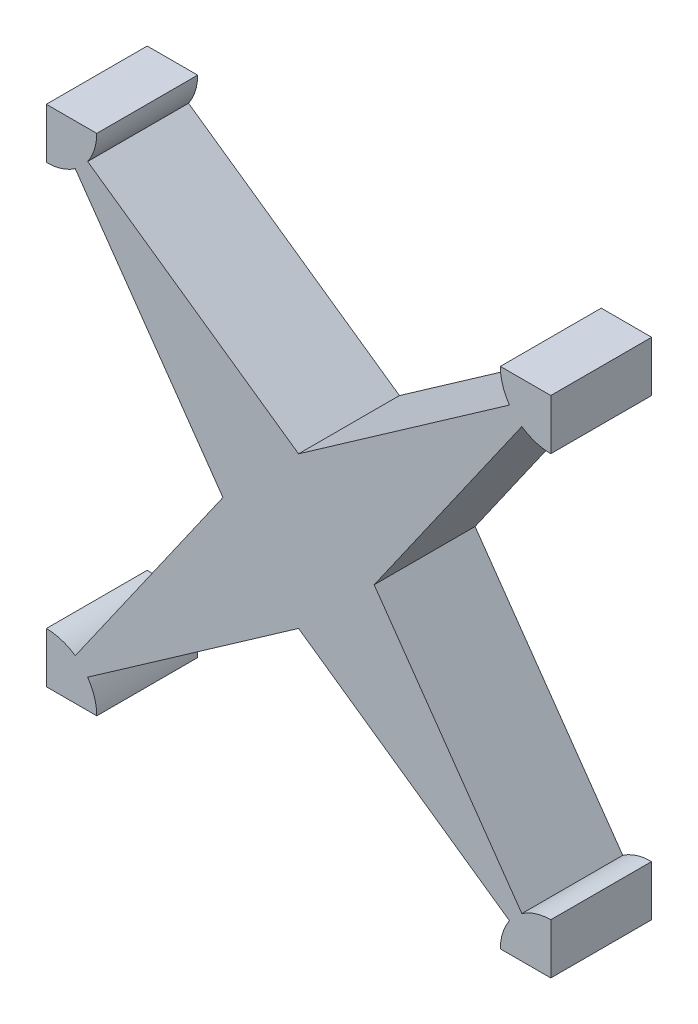
ISO-10303-21;
HEADER;
FILE_DESCRIPTION(('STEP AP214'),'2;1');
FILE_NAME('part.step','',(''),(''),'','','');
FILE_SCHEMA(('AUTOMOTIVE_DESIGN { 1 0 10303 214 1 1 1 1 }'));
ENDSEC;
DATA;
#1=APPLICATION_CONTEXT('core data for automotive mechanical design processes');
#2=APPLICATION_PROTOCOL_DEFINITION('international standard','automotive_design',2000,#1);
#3=PRODUCT_CONTEXT('',#1,'mechanical');
#4=PRODUCT('Part','Part','',(#3));
#5=PRODUCT_RELATED_PRODUCT_CATEGORY('part','',(#4));
#6=PRODUCT_DEFINITION_FORMATION('','',#4);
#7=PRODUCT_DEFINITION_CONTEXT('part definition',#1,'design');
#8=PRODUCT_DEFINITION('design','',#6,#7);
#9=PRODUCT_DEFINITION_SHAPE('','',#8);
#10=(LENGTH_UNIT() NAMED_UNIT(*) SI_UNIT(.MILLI.,.METRE.));
#11=(NAMED_UNIT(*) PLANE_ANGLE_UNIT() SI_UNIT($,.RADIAN.));
#12=(NAMED_UNIT(*) SI_UNIT($,.STERADIAN.) SOLID_ANGLE_UNIT());
#13=UNCERTAINTY_MEASURE_WITH_UNIT(LENGTH_MEASURE(1.E-05),#10,'distance_accuracy_value','');
#14=(GEOMETRIC_REPRESENTATION_CONTEXT(3) GLOBAL_UNCERTAINTY_ASSIGNED_CONTEXT((#13)) GLOBAL_UNIT_ASSIGNED_CONTEXT((#10,
#11,#12)) REPRESENTATION_CONTEXT('',''));
#15=CARTESIAN_POINT('',(0.,0.,0.));
#16=DIRECTION('',(0.,0.,1.));
#17=DIRECTION('',(1.,0.,0.));
#18=AXIS2_PLACEMENT_3D('',#15,#16,#17);
#19=CARTESIAN_POINT('',(0.,0.,5.));
#20=DIRECTION('',(-0.573576436351047,0.819152044288991,0.));
#21=DIRECTION('',(-0.819152044288991,-0.573576436351047,0.));
#22=AXIS2_PLACEMENT_3D('',#19,#20,#21);
#23=PLANE('',#22);
#24=DIRECTION('',(0.819152044288991,0.573576436351047,0.));
#25=VECTOR('',#24,1.);
#26=CARTESIAN_POINT('',(0.,0.,5.));
#27=LINE('',#26,#25);
#28=CARTESIAN_POINT('',(2.04788011072248,1.43394109087762,5.));
#29=VERTEX_POINT('',#28);
#30=CARTESIAN_POINT('',(12.5,8.7525942276214,5.));
#31=VERTEX_POINT('',#30);
#32=EDGE_CURVE('E56',#29,#31,#27,.T.);
#33=ORIENTED_EDGE('',*,*,#32,.F.);
#34=DIRECTION('',(0.,0.,1.));
#35=VECTOR('',#34,1.);
#36=CARTESIAN_POINT('',(2.04788011072248,1.43394109087762,-3.53553390593274));
#37=LINE('',#36,#35);
#38=CARTESIAN_POINT('',(2.04788011072248,1.43394109087762,0.));
#39=VERTEX_POINT('',#38);
#40=EDGE_CURVE('E248',#29,#39,#37,.F.);
#41=ORIENTED_EDGE('',*,*,#40,.T.);
#42=DIRECTION('',(0.819152044288991,0.573576436351047,0.));
#43=VECTOR('',#42,1.);
#44=CARTESIAN_POINT('',(0.,0.,0.));
#45=LINE('',#44,#43);
#46=CARTESIAN_POINT('',(12.5,8.7525942276214,0.));
#47=VERTEX_POINT('',#46);
#48=EDGE_CURVE('E374',#39,#47,#45,.T.);
#49=ORIENTED_EDGE('',*,*,#48,.T.);
#50=DIRECTION('',(0.,0.,-1.));
#51=VECTOR('',#50,1.);
#52=CARTESIAN_POINT('',(12.5,8.7525942276214,5.));
#53=LINE('',#52,#51);
#54=EDGE_CURVE('E11',#31,#47,#53,.T.);
#55=ORIENTED_EDGE('',*,*,#54,.F.);
#56=EDGE_LOOP('',(#33,#41,#49,#55));
#57=FACE_BOUND('',#56,.T.);
#58=ADVANCED_FACE('F41',(#57),#23,.F.);
#59=CARTESIAN_POINT('',(12.5,8.7525942276214,5.));
#60=DIRECTION('',(0.573576436351047,0.819152044288991,0.));
#61=DIRECTION('',(-0.819152044288991,0.573576436351047,0.));
#62=AXIS2_PLACEMENT_3D('',#59,#60,#61);
#63=PLANE('',#62);
#64=DIRECTION('',(0.819152044288991,-0.573576436351047,0.));
#65=VECTOR('',#64,1.);
#66=CARTESIAN_POINT('',(12.5,8.7525942276214,0.));
#67=LINE('',#66,#65);
#68=CARTESIAN_POINT('',(22.9521198892775,1.43394109087761,0.));
#69=VERTEX_POINT('',#68);
#70=EDGE_CURVE('E404',#47,#69,#67,.T.);
#71=ORIENTED_EDGE('',*,*,#70,.T.);
#72=DIRECTION('',(0.,0.,1.));
#73=VECTOR('',#72,1.);
#74=CARTESIAN_POINT('',(22.9521198892775,1.43394109087761,-3.53553390593274));
#75=LINE('',#74,#73);
#76=CARTESIAN_POINT('',(22.9521198892775,1.43394109087761,5.));
#77=VERTEX_POINT('',#76);
#78=EDGE_CURVE('E289',#69,#77,#75,.T.);
#79=ORIENTED_EDGE('',*,*,#78,.T.);
#80=DIRECTION('',(0.819152044288991,-0.573576436351047,0.));
#81=VECTOR('',#80,1.);
#82=CARTESIAN_POINT('',(12.5,8.7525942276214,5.));
#83=LINE('',#82,#81);
#84=EDGE_CURVE('E377',#31,#77,#83,.T.);
#85=ORIENTED_EDGE('',*,*,#84,.F.);
#86=ORIENTED_EDGE('',*,*,#54,.T.);
#87=EDGE_LOOP('',(#71,#79,#85,#86));
#88=FACE_BOUND('',#87,.T.);
#89=ADVANCED_FACE('F505',(#88),#63,.F.);
#90=CARTESIAN_POINT('',(25.,0.,5.));
#91=DIRECTION('',(-0.819152044288991,-0.573576436351047,0.));
#92=DIRECTION('',(0.573576436351047,-0.819152044288991,0.));
#93=AXIS2_PLACEMENT_3D('',#90,#91,#92);
#94=PLANE('',#93);
#95=DIRECTION('',(-0.573576436351047,0.819152044288991,0.));
#96=VECTOR('',#95,1.);
#97=CARTESIAN_POINT('',(25.,0.,5.));
#98=LINE('',#97,#96);
#99=CARTESIAN_POINT('',(23.5660589091224,2.04788011072247,5.));
#100=VERTEX_POINT('',#99);
#101=CARTESIAN_POINT('',(16.2474057723786,12.5,5.));
#102=VERTEX_POINT('',#101);
#103=EDGE_CURVE('E382',#100,#102,#98,.T.);
#104=ORIENTED_EDGE('',*,*,#103,.F.);
#105=DIRECTION('',(0.,0.,1.));
#106=VECTOR('',#105,1.);
#107=CARTESIAN_POINT('',(23.5660589091224,2.04788011072247,-3.53553390593274));
#108=LINE('',#107,#106);
#109=CARTESIAN_POINT('',(23.5660589091224,2.04788011072247,0.));
#110=VERTEX_POINT('',#109);
#111=EDGE_CURVE('E285',#100,#110,#108,.F.);
#112=ORIENTED_EDGE('',*,*,#111,.T.);
#113=DIRECTION('',(-0.573576436351047,0.819152044288991,0.));
#114=VECTOR('',#113,1.);
#115=CARTESIAN_POINT('',(25.,0.,0.));
#116=LINE('',#115,#114);
#117=CARTESIAN_POINT('',(16.2474057723786,12.5,0.));
#118=VERTEX_POINT('',#117);
#119=EDGE_CURVE('E407',#110,#118,#116,.T.);
#120=ORIENTED_EDGE('',*,*,#119,.T.);
#121=DIRECTION('',(0.,0.,-1.));
#122=VECTOR('',#121,1.);
#123=CARTESIAN_POINT('',(16.2474057723786,12.5,5.));
#124=LINE('',#123,#122);
#125=EDGE_CURVE('E49',#102,#118,#124,.T.);
#126=ORIENTED_EDGE('',*,*,#125,.F.);
#127=EDGE_LOOP('',(#104,#112,#120,#126));
#128=FACE_BOUND('',#127,.T.);
#129=ADVANCED_FACE('F509',(#128),#94,.F.);
#130=CARTESIAN_POINT('',(16.2474057723786,12.5,5.));
#131=DIRECTION('',(-0.819152044288991,0.573576436351047,0.));
#132=DIRECTION('',(-0.573576436351047,-0.819152044288991,0.));
#133=AXIS2_PLACEMENT_3D('',#130,#131,#132);
#134=PLANE('',#133);
#135=DIRECTION('',(0.573576436351047,0.819152044288991,0.));
#136=VECTOR('',#135,1.);
#137=CARTESIAN_POINT('',(16.2474057723786,12.5,0.));
#138=LINE('',#137,#136);
#139=CARTESIAN_POINT('',(23.5660589091224,22.9521198892775,0.));
#140=VERTEX_POINT('',#139);
#141=EDGE_CURVE('E410',#118,#140,#138,.T.);
#142=ORIENTED_EDGE('',*,*,#141,.T.);
#143=DIRECTION('',(0.,0.,1.));
#144=VECTOR('',#143,1.);
#145=CARTESIAN_POINT('',(23.5660589091224,22.9521198892775,-3.53553390593274));
#146=LINE('',#145,#144);
#147=CARTESIAN_POINT('',(23.5660589091224,22.9521198892775,5.));
#148=VERTEX_POINT('',#147);
#149=EDGE_CURVE('E330',#140,#148,#146,.T.);
#150=ORIENTED_EDGE('',*,*,#149,.T.);
#151=DIRECTION('',(0.573576436351047,0.819152044288991,0.));
#152=VECTOR('',#151,1.);
#153=CARTESIAN_POINT('',(16.2474057723786,12.5,5.));
#154=LINE('',#153,#152);
#155=EDGE_CURVE('E385',#102,#148,#154,.T.);
#156=ORIENTED_EDGE('',*,*,#155,.F.);
#157=ORIENTED_EDGE('',*,*,#125,.T.);
#158=EDGE_LOOP('',(#142,#150,#156,#157));
#159=FACE_BOUND('',#158,.T.);
#160=ADVANCED_FACE('F436',(#159),#134,.F.);
#161=CARTESIAN_POINT('',(25.,25.,5.));
#162=DIRECTION('',(0.573576436351041,-0.819152044288995,0.));
#163=DIRECTION('',(0.819152044288995,0.573576436351041,0.));
#164=AXIS2_PLACEMENT_3D('',#161,#162,#163);
#165=PLANE('',#164);
#166=DIRECTION('',(-0.819152044288995,-0.573576436351041,0.));
#167=VECTOR('',#166,1.);
#168=CARTESIAN_POINT('',(25.,25.,5.));
#169=LINE('',#168,#167);
#170=CARTESIAN_POINT('',(22.9521198892775,23.5660589091224,5.));
#171=VERTEX_POINT('',#170);
#172=CARTESIAN_POINT('',(12.5,16.2474057723788,5.));
#173=VERTEX_POINT('',#172);
#174=EDGE_CURVE('E389',#171,#173,#169,.T.);
#175=ORIENTED_EDGE('',*,*,#174,.F.);
#176=DIRECTION('',(0.,0.,1.));
#177=VECTOR('',#176,1.);
#178=CARTESIAN_POINT('',(22.9521198892775,23.5660589091224,-3.53553390593274));
#179=LINE('',#178,#177);
#180=CARTESIAN_POINT('',(22.9521198892775,23.5660589091224,0.));
#181=VERTEX_POINT('',#180);
#182=EDGE_CURVE('E326',#171,#181,#179,.F.);
#183=ORIENTED_EDGE('',*,*,#182,.T.);
#184=DIRECTION('',(-0.819152044288995,-0.573576436351041,0.));
#185=VECTOR('',#184,1.);
#186=CARTESIAN_POINT('',(25.,25.,0.));
#187=LINE('',#186,#185);
#188=CARTESIAN_POINT('',(12.5,16.2474057723788,0.));
#189=VERTEX_POINT('',#188);
#190=EDGE_CURVE('E413',#181,#189,#187,.T.);
#191=ORIENTED_EDGE('',*,*,#190,.T.);
#192=DIRECTION('',(0.,0.,-1.));
#193=VECTOR('',#192,1.);
#194=CARTESIAN_POINT('',(12.5,16.2474057723788,5.));
#195=LINE('',#194,#193);
#196=EDGE_CURVE('E427',#173,#189,#195,.T.);
#197=ORIENTED_EDGE('',*,*,#196,.F.);
#198=EDGE_LOOP('',(#175,#183,#191,#197));
#199=FACE_BOUND('',#198,.T.);
#200=ADVANCED_FACE('F466',(#199),#165,.F.);
#201=CARTESIAN_POINT('',(12.5,16.2474057723788,5.));
#202=DIRECTION('',(-0.573576436351041,-0.819152044288996,0.));
#203=DIRECTION('',(0.819152044288996,-0.573576436351041,0.));
#204=AXIS2_PLACEMENT_3D('',#201,#202,#203);
#205=PLANE('',#204);
#206=DIRECTION('',(-0.819152044288996,0.573576436351041,0.));
#207=VECTOR('',#206,1.);
#208=CARTESIAN_POINT('',(12.5,16.2474057723788,0.));
#209=LINE('',#208,#207);
#210=CARTESIAN_POINT('',(2.04788011072249,23.5660589091224,0.));
#211=VERTEX_POINT('',#210);
#212=EDGE_CURVE('E416',#189,#211,#209,.T.);
#213=ORIENTED_EDGE('',*,*,#212,.T.);
#214=DIRECTION('',(0.,0.,1.));
#215=VECTOR('',#214,1.);
#216=CARTESIAN_POINT('',(2.04788011072249,23.5660589091224,-3.53553390593274));
#217=LINE('',#216,#215);
#218=CARTESIAN_POINT('',(2.04788011072249,23.5660589091224,5.));
#219=VERTEX_POINT('',#218);
#220=EDGE_CURVE('E371',#211,#219,#217,.T.);
#221=ORIENTED_EDGE('',*,*,#220,.T.);
#222=DIRECTION('',(-0.819152044288996,0.573576436351041,0.));
#223=VECTOR('',#222,1.);
#224=CARTESIAN_POINT('',(12.5,16.2474057723788,5.));
#225=LINE('',#224,#223);
#226=EDGE_CURVE('E392',#173,#219,#225,.T.);
#227=ORIENTED_EDGE('',*,*,#226,.F.);
#228=ORIENTED_EDGE('',*,*,#196,.T.);
#229=EDGE_LOOP('',(#213,#221,#227,#228));
#230=FACE_BOUND('',#229,.T.);
#231=ADVANCED_FACE('F469',(#230),#205,.F.);
#232=CARTESIAN_POINT('',(0.,25.,5.));
#233=DIRECTION('',(0.819152044288991,0.573576436351047,0.));
#234=DIRECTION('',(-0.573576436351047,0.819152044288991,0.));
#235=AXIS2_PLACEMENT_3D('',#232,#233,#234);
#236=PLANE('',#235);
#237=DIRECTION('',(0.573576436351047,-0.819152044288991,0.));
#238=VECTOR('',#237,1.);
#239=CARTESIAN_POINT('',(0.,25.,5.));
#240=LINE('',#239,#238);
#241=CARTESIAN_POINT('',(1.43394109087762,22.9521198892775,5.));
#242=VERTEX_POINT('',#241);
#243=CARTESIAN_POINT('',(8.7525942276214,12.5,5.));
#244=VERTEX_POINT('',#243);
#245=EDGE_CURVE('E396',#242,#244,#240,.T.);
#246=ORIENTED_EDGE('',*,*,#245,.F.);
#247=DIRECTION('',(0.,0.,1.));
#248=VECTOR('',#247,1.);
#249=CARTESIAN_POINT('',(1.43394109087762,22.9521198892775,-3.53553390593274));
#250=LINE('',#249,#248);
#251=CARTESIAN_POINT('',(1.43394109087761,22.9521198892775,0.));
#252=VERTEX_POINT('',#251);
#253=EDGE_CURVE('E367',#242,#252,#250,.F.);
#254=ORIENTED_EDGE('',*,*,#253,.T.);
#255=DIRECTION('',(0.573576436351047,-0.819152044288991,0.));
#256=VECTOR('',#255,1.);
#257=CARTESIAN_POINT('',(0.,25.,0.));
#258=LINE('',#257,#256);
#259=CARTESIAN_POINT('',(8.7525942276214,12.5,0.));
#260=VERTEX_POINT('',#259);
#261=EDGE_CURVE('E419',#252,#260,#258,.T.);
#262=ORIENTED_EDGE('',*,*,#261,.T.);
#263=DIRECTION('',(0.,0.,-1.));
#264=VECTOR('',#263,1.);
#265=CARTESIAN_POINT('',(8.7525942276214,12.5,5.));
#266=LINE('',#265,#264);
#267=EDGE_CURVE('E401',#244,#260,#266,.T.);
#268=ORIENTED_EDGE('',*,*,#267,.F.);
#269=EDGE_LOOP('',(#246,#254,#262,#268));
#270=FACE_BOUND('',#269,.T.);
#271=ADVANCED_FACE('F492',(#270),#236,.F.);
#272=CARTESIAN_POINT('',(0.,0.,5.));
#273=DIRECTION('',(0.819152044288991,-0.573576436351047,0.));
#274=DIRECTION('',(0.573576436351047,0.819152044288991,0.));
#275=AXIS2_PLACEMENT_3D('',#272,#273,#274);
#276=PLANE('',#275);
#277=DIRECTION('',(-0.573576436351047,-0.819152044288991,0.));
#278=VECTOR('',#277,1.);
#279=CARTESIAN_POINT('',(0.,0.,0.));
#280=LINE('',#279,#278);
#281=CARTESIAN_POINT('',(1.43394109087762,2.04788011072248,0.));
#282=VERTEX_POINT('',#281);
#283=EDGE_CURVE('E378',#260,#282,#280,.T.);
#284=ORIENTED_EDGE('',*,*,#283,.T.);
#285=DIRECTION('',(0.,0.,1.));
#286=VECTOR('',#285,1.);
#287=CARTESIAN_POINT('',(1.43394109087762,2.04788011072248,-3.53553390593274));
#288=LINE('',#287,#286);
#289=CARTESIAN_POINT('',(1.43394109087762,2.04788011072248,5.));
#290=VERTEX_POINT('',#289);
#291=EDGE_CURVE('E64',#282,#290,#288,.T.);
#292=ORIENTED_EDGE('',*,*,#291,.T.);
#293=DIRECTION('',(-0.573576436351047,-0.819152044288991,0.));
#294=VECTOR('',#293,1.);
#295=CARTESIAN_POINT('',(0.,0.,5.));
#296=LINE('',#295,#294);
#297=EDGE_CURVE('E210',#244,#290,#296,.T.);
#298=ORIENTED_EDGE('',*,*,#297,.F.);
#299=ORIENTED_EDGE('',*,*,#267,.T.);
#300=EDGE_LOOP('',(#284,#292,#298,#299));
#301=FACE_BOUND('',#300,.T.);
#302=ADVANCED_FACE('F494',(#301),#276,.F.);
#303=CARTESIAN_POINT('',(0.,0.,5.));
#304=DIRECTION('',(0.,0.,1.));
#305=DIRECTION('',(1.,0.,0.));
#306=AXIS2_PLACEMENT_3D('',#303,#304,#305);
#307=PLANE('',#306);
#308=ORIENTED_EDGE('',*,*,#297,.T.);
#309=CARTESIAN_POINT('',(0.,0.,5.));
#310=DIRECTION('',(0.,0.,1.));
#311=DIRECTION('',(1.,0.,0.));
#312=AXIS2_PLACEMENT_3D('',#309,#310,#311);
#313=CIRCLE('',#312,2.5);
#314=CARTESIAN_POINT('',(0.,2.5,5.));
#315=VERTEX_POINT('',#314);
#316=EDGE_CURVE('E203',#290,#315,#313,.T.);
#317=ORIENTED_EDGE('',*,*,#316,.T.);
#318=DIRECTION('',(0.,-1.,0.));
#319=VECTOR('',#318,1.);
#320=CARTESIAN_POINT('',(0.,2.5,5.));
#321=LINE('',#320,#319);
#322=CARTESIAN_POINT('',(0.,0.,5.));
#323=VERTEX_POINT('',#322);
#324=EDGE_CURVE('E208',#315,#323,#321,.T.);
#325=ORIENTED_EDGE('',*,*,#324,.T.);
#326=DIRECTION('',(1.,0.,0.));
#327=VECTOR('',#326,1.);
#328=CARTESIAN_POINT('',(0.,0.,5.));
#329=LINE('',#328,#327);
#330=CARTESIAN_POINT('',(2.5,0.,5.));
#331=VERTEX_POINT('',#330);
#332=EDGE_CURVE('E225',#323,#331,#329,.T.);
#333=ORIENTED_EDGE('',*,*,#332,.T.);
#334=EDGE_CURVE('E213',#331,#29,#313,.T.);
#335=ORIENTED_EDGE('',*,*,#334,.T.);
#336=ORIENTED_EDGE('',*,*,#32,.T.);
#337=ORIENTED_EDGE('',*,*,#84,.T.);
#338=CARTESIAN_POINT('',(25.,0.,5.));
#339=DIRECTION('',(0.,0.,1.));
#340=DIRECTION('',(-1.,0.,0.));
#341=AXIS2_PLACEMENT_3D('',#338,#339,#340);
#342=CIRCLE('',#341,2.5);
#343=CARTESIAN_POINT('',(22.5,0.,5.));
#344=VERTEX_POINT('',#343);
#345=EDGE_CURVE('E251',#77,#344,#342,.T.);
#346=ORIENTED_EDGE('',*,*,#345,.T.);
#347=DIRECTION('',(1.,0.,0.));
#348=VECTOR('',#347,1.);
#349=CARTESIAN_POINT('',(25.,0.,5.));
#350=LINE('',#349,#348);
#351=CARTESIAN_POINT('',(25.,0.,5.));
#352=VERTEX_POINT('',#351);
#353=EDGE_CURVE('E266',#344,#352,#350,.T.);
#354=ORIENTED_EDGE('',*,*,#353,.T.);
#355=DIRECTION('',(0.,1.,0.));
#356=VECTOR('',#355,1.);
#357=CARTESIAN_POINT('',(25.,2.5,5.));
#358=LINE('',#357,#356);
#359=CARTESIAN_POINT('',(25.,2.5,5.));
#360=VERTEX_POINT('',#359);
#361=EDGE_CURVE('E270',#352,#360,#358,.T.);
#362=ORIENTED_EDGE('',*,*,#361,.T.);
#363=EDGE_CURVE('E262',#360,#100,#342,.T.);
#364=ORIENTED_EDGE('',*,*,#363,.T.);
#365=ORIENTED_EDGE('',*,*,#103,.T.);
#366=ORIENTED_EDGE('',*,*,#155,.T.);
#367=CARTESIAN_POINT('',(25.,25.,5.));
#368=DIRECTION('',(0.,0.,1.));
#369=DIRECTION('',(1.,0.,0.));
#370=AXIS2_PLACEMENT_3D('',#367,#368,#369);
#371=CIRCLE('',#370,2.5);
#372=CARTESIAN_POINT('',(25.,22.5,5.));
#373=VERTEX_POINT('',#372);
#374=EDGE_CURVE('E292',#148,#373,#371,.T.);
#375=ORIENTED_EDGE('',*,*,#374,.T.);
#376=DIRECTION('',(0.,1.,0.));
#377=VECTOR('',#376,1.);
#378=CARTESIAN_POINT('',(25.,22.5,5.));
#379=LINE('',#378,#377);
#380=CARTESIAN_POINT('',(25.,25.,5.));
#381=VERTEX_POINT('',#380);
#382=EDGE_CURVE('E307',#373,#381,#379,.T.);
#383=ORIENTED_EDGE('',*,*,#382,.T.);
#384=DIRECTION('',(-1.,0.,0.));
#385=VECTOR('',#384,1.);
#386=CARTESIAN_POINT('',(25.,25.,5.));
#387=LINE('',#386,#385);
#388=CARTESIAN_POINT('',(22.5,25.,5.));
#389=VERTEX_POINT('',#388);
#390=EDGE_CURVE('E311',#381,#389,#387,.T.);
#391=ORIENTED_EDGE('',*,*,#390,.T.);
#392=EDGE_CURVE('E303',#389,#171,#371,.T.);
#393=ORIENTED_EDGE('',*,*,#392,.T.);
#394=ORIENTED_EDGE('',*,*,#174,.T.);
#395=ORIENTED_EDGE('',*,*,#226,.T.);
#396=CARTESIAN_POINT('',(0.,25.,5.));
#397=DIRECTION('',(0.,0.,1.));
#398=DIRECTION('',(-1.,0.,0.));
#399=AXIS2_PLACEMENT_3D('',#396,#397,#398);
#400=CIRCLE('',#399,2.5);
#401=CARTESIAN_POINT('',(2.5,25.,5.));
#402=VERTEX_POINT('',#401);
#403=EDGE_CURVE('E333',#219,#402,#400,.T.);
#404=ORIENTED_EDGE('',*,*,#403,.T.);
#405=DIRECTION('',(-1.,0.,0.));
#406=VECTOR('',#405,1.);
#407=CARTESIAN_POINT('',(0.,25.,5.));
#408=LINE('',#407,#406);
#409=CARTESIAN_POINT('',(0.,25.,5.));
#410=VERTEX_POINT('',#409);
#411=EDGE_CURVE('E348',#402,#410,#408,.T.);
#412=ORIENTED_EDGE('',*,*,#411,.T.);
#413=DIRECTION('',(0.,-1.,0.));
#414=VECTOR('',#413,1.);
#415=CARTESIAN_POINT('',(0.,22.5,5.));
#416=LINE('',#415,#414);
#417=CARTESIAN_POINT('',(0.,22.5,5.));
#418=VERTEX_POINT('',#417);
#419=EDGE_CURVE('E352',#410,#418,#416,.T.);
#420=ORIENTED_EDGE('',*,*,#419,.T.);
#421=EDGE_CURVE('E344',#418,#242,#400,.T.);
#422=ORIENTED_EDGE('',*,*,#421,.T.);
#423=ORIENTED_EDGE('',*,*,#245,.T.);
#424=EDGE_LOOP('',(#308,#317,#325,#333,#335,#336,#337,#346,#354,#362,#364,#365,#366,#375,#383,
#391,#393,#394,#395,#404,#412,#420,#422,#423));
#425=FACE_BOUND('',#424,.T.);
#426=ADVANCED_FACE('F205',(#425),#307,.T.);
#427=CARTESIAN_POINT('',(0.,0.,0.));
#428=DIRECTION('',(0.,0.,1.));
#429=DIRECTION('',(1.,0.,0.));
#430=AXIS2_PLACEMENT_3D('',#427,#428,#429);
#431=PLANE('',#430);
#432=ORIENTED_EDGE('',*,*,#48,.F.);
#433=CARTESIAN_POINT('',(0.,0.,0.));
#434=DIRECTION('',(0.,0.,1.));
#435=DIRECTION('',(1.,0.,0.));
#436=AXIS2_PLACEMENT_3D('',#433,#434,#435);
#437=CIRCLE('',#436,2.5);
#438=CARTESIAN_POINT('',(2.5,0.,0.));
#439=VERTEX_POINT('',#438);
#440=EDGE_CURVE('E694',#39,#439,#437,.F.);
#441=ORIENTED_EDGE('',*,*,#440,.T.);
#442=DIRECTION('',(-1.,0.,0.));
#443=VECTOR('',#442,1.);
#444=CARTESIAN_POINT('',(0.,0.,0.));
#445=LINE('',#444,#443);
#446=CARTESIAN_POINT('',(0.,0.,0.));
#447=VERTEX_POINT('',#446);
#448=EDGE_CURVE('E240',#439,#447,#445,.T.);
#449=ORIENTED_EDGE('',*,*,#448,.T.);
#450=DIRECTION('',(0.,1.,0.));
#451=VECTOR('',#450,1.);
#452=CARTESIAN_POINT('',(0.,2.5,0.));
#453=LINE('',#452,#451);
#454=CARTESIAN_POINT('',(0.,2.5,0.));
#455=VERTEX_POINT('',#454);
#456=EDGE_CURVE('E243',#447,#455,#453,.T.);
#457=ORIENTED_EDGE('',*,*,#456,.T.);
#458=EDGE_CURVE('E220',#455,#282,#437,.F.);
#459=ORIENTED_EDGE('',*,*,#458,.T.);
#460=ORIENTED_EDGE('',*,*,#283,.F.);
#461=ORIENTED_EDGE('',*,*,#261,.F.);
#462=CARTESIAN_POINT('',(0.,25.,0.));
#463=DIRECTION('',(0.,0.,1.));
#464=DIRECTION('',(1.,0.,0.));
#465=AXIS2_PLACEMENT_3D('',#462,#463,#464);
#466=CIRCLE('',#465,2.5);
#467=CARTESIAN_POINT('',(0.,22.5,0.));
#468=VERTEX_POINT('',#467);
#469=EDGE_CURVE('E337',#252,#468,#466,.F.);
#470=ORIENTED_EDGE('',*,*,#469,.T.);
#471=DIRECTION('',(0.,1.,0.));
#472=VECTOR('',#471,1.);
#473=CARTESIAN_POINT('',(0.,22.5,0.));
#474=LINE('',#473,#472);
#475=CARTESIAN_POINT('',(0.,25.,0.));
#476=VERTEX_POINT('',#475);
#477=EDGE_CURVE('E334',#468,#476,#474,.T.);
#478=ORIENTED_EDGE('',*,*,#477,.T.);
#479=DIRECTION('',(1.,0.,0.));
#480=VECTOR('',#479,1.);
#481=CARTESIAN_POINT('',(0.,25.,0.));
#482=LINE('',#481,#480);
#483=CARTESIAN_POINT('',(2.5,25.,0.));
#484=VERTEX_POINT('',#483);
#485=EDGE_CURVE('E343',#476,#484,#482,.T.);
#486=ORIENTED_EDGE('',*,*,#485,.T.);
#487=EDGE_CURVE('E339',#484,#211,#466,.F.);
#488=ORIENTED_EDGE('',*,*,#487,.T.);
#489=ORIENTED_EDGE('',*,*,#212,.F.);
#490=ORIENTED_EDGE('',*,*,#190,.F.);
#491=CARTESIAN_POINT('',(25.,25.,0.));
#492=DIRECTION('',(0.,0.,1.));
#493=DIRECTION('',(1.,0.,0.));
#494=AXIS2_PLACEMENT_3D('',#491,#492,#493);
#495=CIRCLE('',#494,2.5);
#496=CARTESIAN_POINT('',(22.5,25.,0.));
#497=VERTEX_POINT('',#496);
#498=EDGE_CURVE('E296',#181,#497,#495,.F.);
#499=ORIENTED_EDGE('',*,*,#498,.T.);
#500=DIRECTION('',(1.,0.,0.));
#501=VECTOR('',#500,1.);
#502=CARTESIAN_POINT('',(25.,25.,0.));
#503=LINE('',#502,#501);
#504=CARTESIAN_POINT('',(25.,25.,0.));
#505=VERTEX_POINT('',#504);
#506=EDGE_CURVE('E293',#497,#505,#503,.T.);
#507=ORIENTED_EDGE('',*,*,#506,.T.);
#508=DIRECTION('',(0.,-1.,0.));
#509=VECTOR('',#508,1.);
#510=CARTESIAN_POINT('',(25.,22.5,0.));
#511=LINE('',#510,#509);
#512=CARTESIAN_POINT('',(25.,22.5,0.));
#513=VERTEX_POINT('',#512);
#514=EDGE_CURVE('E302',#505,#513,#511,.T.);
#515=ORIENTED_EDGE('',*,*,#514,.T.);
#516=EDGE_CURVE('E298',#513,#140,#495,.F.);
#517=ORIENTED_EDGE('',*,*,#516,.T.);
#518=ORIENTED_EDGE('',*,*,#141,.F.);
#519=ORIENTED_EDGE('',*,*,#119,.F.);
#520=CARTESIAN_POINT('',(25.,0.,0.));
#521=DIRECTION('',(0.,0.,1.));
#522=DIRECTION('',(1.,0.,0.));
#523=AXIS2_PLACEMENT_3D('',#520,#521,#522);
#524=CIRCLE('',#523,2.5);
#525=CARTESIAN_POINT('',(25.,2.5,0.));
#526=VERTEX_POINT('',#525);
#527=EDGE_CURVE('E255',#110,#526,#524,.F.);
#528=ORIENTED_EDGE('',*,*,#527,.T.);
#529=DIRECTION('',(0.,-1.,0.));
#530=VECTOR('',#529,1.);
#531=CARTESIAN_POINT('',(25.,2.5,0.));
#532=LINE('',#531,#530);
#533=CARTESIAN_POINT('',(25.,0.,0.));
#534=VERTEX_POINT('',#533);
#535=EDGE_CURVE('E252',#526,#534,#532,.T.);
#536=ORIENTED_EDGE('',*,*,#535,.T.);
#537=DIRECTION('',(-1.,0.,0.));
#538=VECTOR('',#537,1.);
#539=CARTESIAN_POINT('',(25.,0.,0.));
#540=LINE('',#539,#538);
#541=CARTESIAN_POINT('',(22.5,0.,0.));
#542=VERTEX_POINT('',#541);
#543=EDGE_CURVE('E261',#534,#542,#540,.T.);
#544=ORIENTED_EDGE('',*,*,#543,.T.);
#545=EDGE_CURVE('E257',#542,#69,#524,.F.);
#546=ORIENTED_EDGE('',*,*,#545,.T.);
#547=ORIENTED_EDGE('',*,*,#70,.F.);
#548=EDGE_LOOP('',(#432,#441,#449,#457,#459,#460,#461,#470,#478,#486,#488,#489,#490,#499,#507,
#515,#517,#518,#519,#528,#536,#544,#546,#547));
#549=FACE_BOUND('',#548,.T.);
#550=ADVANCED_FACE('F441',(#549),#431,.F.);
#551=CARTESIAN_POINT('',(0.,25.,-3.53553390593274));
#552=DIRECTION('',(0.,0.,1.));
#553=DIRECTION('',(1.,0.,0.));
#554=AXIS2_PLACEMENT_3D('',#551,#552,#553);
#555=CYLINDRICAL_SURFACE('',#554,2.5);
#556=ORIENTED_EDGE('',*,*,#220,.F.);
#557=ORIENTED_EDGE('',*,*,#487,.F.);
#558=DIRECTION('',(0.,0.,1.));
#559=VECTOR('',#558,1.);
#560=CARTESIAN_POINT('',(2.5,25.,-3.53553390593274));
#561=LINE('',#560,#559);
#562=EDGE_CURVE('E356',#484,#402,#561,.T.);
#563=ORIENTED_EDGE('',*,*,#562,.T.);
#564=ORIENTED_EDGE('',*,*,#403,.F.);
#565=EDGE_LOOP('',(#556,#557,#563,#564));
#566=FACE_BOUND('',#565,.T.);
#567=ADVANCED_FACE('F473',(#566),#555,.T.);
#568=ORIENTED_EDGE('',*,*,#253,.F.);
#569=ORIENTED_EDGE('',*,*,#421,.F.);
#570=DIRECTION('',(0.,0.,1.));
#571=VECTOR('',#570,1.);
#572=CARTESIAN_POINT('',(0.,22.5,-3.53553390593274));
#573=LINE('',#572,#571);
#574=EDGE_CURVE('E338',#468,#418,#573,.T.);
#575=ORIENTED_EDGE('',*,*,#574,.F.);
#576=ORIENTED_EDGE('',*,*,#469,.F.);
#577=EDGE_LOOP('',(#568,#569,#575,#576));
#578=FACE_BOUND('',#577,.T.);
#579=ADVANCED_FACE('F489',(#578),#555,.T.);
#580=CARTESIAN_POINT('',(0.,22.5,-3.53553390593274));
#581=DIRECTION('',(-1.,0.,0.));
#582=DIRECTION('',(0.,-1.,0.));
#583=AXIS2_PLACEMENT_3D('',#580,#581,#582);
#584=PLANE('',#583);
#585=ORIENTED_EDGE('',*,*,#477,.F.);
#586=ORIENTED_EDGE('',*,*,#574,.T.);
#587=ORIENTED_EDGE('',*,*,#419,.F.);
#588=DIRECTION('',(0.,0.,1.));
#589=VECTOR('',#588,1.);
#590=CARTESIAN_POINT('',(0.,25.,-3.53553390593274));
#591=LINE('',#590,#589);
#592=EDGE_CURVE('E359',#476,#410,#591,.T.);
#593=ORIENTED_EDGE('',*,*,#592,.F.);
#594=EDGE_LOOP('',(#585,#586,#587,#593));
#595=FACE_BOUND('',#594,.T.);
#596=ADVANCED_FACE('F483',(#595),#584,.T.);
#597=CARTESIAN_POINT('',(0.,25.,-3.53553390593274));
#598=DIRECTION('',(0.,1.,0.));
#599=DIRECTION('',(0.,0.,1.));
#600=AXIS2_PLACEMENT_3D('',#597,#598,#599);
#601=PLANE('',#600);
#602=ORIENTED_EDGE('',*,*,#485,.F.);
#603=ORIENTED_EDGE('',*,*,#592,.T.);
#604=ORIENTED_EDGE('',*,*,#411,.F.);
#605=ORIENTED_EDGE('',*,*,#562,.F.);
#606=EDGE_LOOP('',(#602,#603,#604,#605));
#607=FACE_BOUND('',#606,.T.);
#608=ADVANCED_FACE('F479',(#607),#601,.T.);
#609=CARTESIAN_POINT('',(25.,25.,-3.53553390593274));
#610=DIRECTION('',(0.,0.,1.));
#611=DIRECTION('',(1.,0.,0.));
#612=AXIS2_PLACEMENT_3D('',#609,#610,#611);
#613=CYLINDRICAL_SURFACE('',#612,2.5);
#614=ORIENTED_EDGE('',*,*,#149,.F.);
#615=ORIENTED_EDGE('',*,*,#516,.F.);
#616=DIRECTION('',(0.,0.,1.));
#617=VECTOR('',#616,1.);
#618=CARTESIAN_POINT('',(25.,22.5,-3.53553390593274));
#619=LINE('',#618,#617);
#620=EDGE_CURVE('E315',#513,#373,#619,.T.);
#621=ORIENTED_EDGE('',*,*,#620,.T.);
#622=ORIENTED_EDGE('',*,*,#374,.F.);
#623=EDGE_LOOP('',(#614,#615,#621,#622));
#624=FACE_BOUND('',#623,.T.);
#625=ADVANCED_FACE('F446',(#624),#613,.T.);
#626=ORIENTED_EDGE('',*,*,#182,.F.);
#627=ORIENTED_EDGE('',*,*,#392,.F.);
#628=DIRECTION('',(0.,0.,1.));
#629=VECTOR('',#628,1.);
#630=CARTESIAN_POINT('',(22.5,25.,-3.53553390593274));
#631=LINE('',#630,#629);
#632=EDGE_CURVE('E297',#497,#389,#631,.T.);
#633=ORIENTED_EDGE('',*,*,#632,.F.);
#634=ORIENTED_EDGE('',*,*,#498,.F.);
#635=EDGE_LOOP('',(#626,#627,#633,#634));
#636=FACE_BOUND('',#635,.T.);
#637=ADVANCED_FACE('F461',(#636),#613,.T.);
#638=CARTESIAN_POINT('',(25.,25.,-3.53553390593274));
#639=DIRECTION('',(0.,1.,0.));
#640=DIRECTION('',(-1.,0.,0.));
#641=AXIS2_PLACEMENT_3D('',#638,#639,#640);
#642=PLANE('',#641);
#643=ORIENTED_EDGE('',*,*,#506,.F.);
#644=ORIENTED_EDGE('',*,*,#632,.T.);
#645=ORIENTED_EDGE('',*,*,#390,.F.);
#646=DIRECTION('',(0.,0.,1.));
#647=VECTOR('',#646,1.);
#648=CARTESIAN_POINT('',(25.,25.,-3.53553390593274));
#649=LINE('',#648,#647);
#650=EDGE_CURVE('E318',#505,#381,#649,.T.);
#651=ORIENTED_EDGE('',*,*,#650,.F.);
#652=EDGE_LOOP('',(#643,#644,#645,#651));
#653=FACE_BOUND('',#652,.T.);
#654=ADVANCED_FACE('F455',(#653),#642,.T.);
#655=CARTESIAN_POINT('',(25.,22.5,-3.53553390593274));
#656=DIRECTION('',(1.,0.,0.));
#657=DIRECTION('',(0.,0.,-1.));
#658=AXIS2_PLACEMENT_3D('',#655,#656,#657);
#659=PLANE('',#658);
#660=ORIENTED_EDGE('',*,*,#514,.F.);
#661=ORIENTED_EDGE('',*,*,#650,.T.);
#662=ORIENTED_EDGE('',*,*,#382,.F.);
#663=ORIENTED_EDGE('',*,*,#620,.F.);
#664=EDGE_LOOP('',(#660,#661,#662,#663));
#665=FACE_BOUND('',#664,.T.);
#666=ADVANCED_FACE('F450',(#665),#659,.T.);
#667=CARTESIAN_POINT('',(25.,0.,-3.53553390593274));
#668=DIRECTION('',(0.,0.,1.));
#669=DIRECTION('',(1.,0.,0.));
#670=AXIS2_PLACEMENT_3D('',#667,#668,#669);
#671=CYLINDRICAL_SURFACE('',#670,2.5);
#672=ORIENTED_EDGE('',*,*,#78,.F.);
#673=ORIENTED_EDGE('',*,*,#545,.F.);
#674=DIRECTION('',(0.,0.,1.));
#675=VECTOR('',#674,1.);
#676=CARTESIAN_POINT('',(22.5,0.,-3.53553390593274));
#677=LINE('',#676,#675);
#678=EDGE_CURVE('E274',#542,#344,#677,.T.);
#679=ORIENTED_EDGE('',*,*,#678,.T.);
#680=ORIENTED_EDGE('',*,*,#345,.F.);
#681=EDGE_LOOP('',(#672,#673,#679,#680));
#682=FACE_BOUND('',#681,.T.);
#683=ADVANCED_FACE('F613',(#682),#671,.T.);
#684=ORIENTED_EDGE('',*,*,#111,.F.);
#685=ORIENTED_EDGE('',*,*,#363,.F.);
#686=DIRECTION('',(0.,0.,1.));
#687=VECTOR('',#686,1.);
#688=CARTESIAN_POINT('',(25.,2.5,-3.53553390593274));
#689=LINE('',#688,#687);
#690=EDGE_CURVE('E256',#526,#360,#689,.T.);
#691=ORIENTED_EDGE('',*,*,#690,.F.);
#692=ORIENTED_EDGE('',*,*,#527,.F.);
#693=EDGE_LOOP('',(#684,#685,#691,#692));
#694=FACE_BOUND('',#693,.T.);
#695=ADVANCED_FACE('F622',(#694),#671,.T.);
#696=CARTESIAN_POINT('',(25.,2.5,-3.53553390593274));
#697=DIRECTION('',(1.,0.,0.));
#698=DIRECTION('',(0.,1.,0.));
#699=AXIS2_PLACEMENT_3D('',#696,#697,#698);
#700=PLANE('',#699);
#701=ORIENTED_EDGE('',*,*,#535,.F.);
#702=ORIENTED_EDGE('',*,*,#690,.T.);
#703=ORIENTED_EDGE('',*,*,#361,.F.);
#704=DIRECTION('',(0.,0.,1.));
#705=VECTOR('',#704,1.);
#706=CARTESIAN_POINT('',(25.,0.,-3.53553390593274));
#707=LINE('',#706,#705);
#708=EDGE_CURVE('E277',#534,#352,#707,.T.);
#709=ORIENTED_EDGE('',*,*,#708,.F.);
#710=EDGE_LOOP('',(#701,#702,#703,#709));
#711=FACE_BOUND('',#710,.T.);
#712=ADVANCED_FACE('F632',(#711),#700,.T.);
#713=CARTESIAN_POINT('',(25.,0.,-3.53553390593274));
#714=DIRECTION('',(0.,-1.,0.));
#715=DIRECTION('',(1.,0.,0.));
#716=AXIS2_PLACEMENT_3D('',#713,#714,#715);
#717=PLANE('',#716);
#718=ORIENTED_EDGE('',*,*,#543,.F.);
#719=ORIENTED_EDGE('',*,*,#708,.T.);
#720=ORIENTED_EDGE('',*,*,#353,.F.);
#721=ORIENTED_EDGE('',*,*,#678,.F.);
#722=EDGE_LOOP('',(#718,#719,#720,#721));
#723=FACE_BOUND('',#722,.T.);
#724=ADVANCED_FACE('F641',(#723),#717,.T.);
#725=CARTESIAN_POINT('',(0.,0.,-3.53553390593274));
#726=DIRECTION('',(0.,0.,1.));
#727=DIRECTION('',(1.,0.,0.));
#728=AXIS2_PLACEMENT_3D('',#725,#726,#727);
#729=CYLINDRICAL_SURFACE('',#728,2.5);
#730=ORIENTED_EDGE('',*,*,#40,.F.);
#731=ORIENTED_EDGE('',*,*,#334,.F.);
#732=DIRECTION('',(0.,0.,1.));
#733=VECTOR('',#732,1.);
#734=CARTESIAN_POINT('',(2.5,0.,-3.53553390593274));
#735=LINE('',#734,#733);
#736=EDGE_CURVE('E237',#439,#331,#735,.T.);
#737=ORIENTED_EDGE('',*,*,#736,.F.);
#738=ORIENTED_EDGE('',*,*,#440,.F.);
#739=EDGE_LOOP('',(#730,#731,#737,#738));
#740=FACE_BOUND('',#739,.T.);
#741=ADVANCED_FACE('F651',(#740),#729,.T.);
#742=ORIENTED_EDGE('',*,*,#291,.F.);
#743=ORIENTED_EDGE('',*,*,#458,.F.);
#744=DIRECTION('',(0.,0.,1.));
#745=VECTOR('',#744,1.);
#746=CARTESIAN_POINT('',(0.,2.5,-3.53553390593274));
#747=LINE('',#746,#745);
#748=EDGE_CURVE('E217',#455,#315,#747,.T.);
#749=ORIENTED_EDGE('',*,*,#748,.T.);
#750=ORIENTED_EDGE('',*,*,#316,.F.);
#751=EDGE_LOOP('',(#742,#743,#749,#750));
#752=FACE_BOUND('',#751,.T.);
#753=ADVANCED_FACE('F218',(#752),#729,.T.);
#754=CARTESIAN_POINT('',(0.,0.,-3.53553390593274));
#755=DIRECTION('',(0.,-1.,0.));
#756=DIRECTION('',(0.,0.,-1.));
#757=AXIS2_PLACEMENT_3D('',#754,#755,#756);
#758=PLANE('',#757);
#759=ORIENTED_EDGE('',*,*,#448,.F.);
#760=ORIENTED_EDGE('',*,*,#736,.T.);
#761=ORIENTED_EDGE('',*,*,#332,.F.);
#762=DIRECTION('',(0.,0.,1.));
#763=VECTOR('',#762,1.);
#764=CARTESIAN_POINT('',(0.,0.,-3.53553390593274));
#765=LINE('',#764,#763);
#766=EDGE_CURVE('E224',#447,#323,#765,.T.);
#767=ORIENTED_EDGE('',*,*,#766,.F.);
#768=EDGE_LOOP('',(#759,#760,#761,#767));
#769=FACE_BOUND('',#768,.T.);
#770=ADVANCED_FACE('F670',(#769),#758,.T.);
#771=CARTESIAN_POINT('',(0.,2.5,-3.53553390593274));
#772=DIRECTION('',(-1.,0.,0.));
#773=DIRECTION('',(0.,0.,1.));
#774=AXIS2_PLACEMENT_3D('',#771,#772,#773);
#775=PLANE('',#774);
#776=ORIENTED_EDGE('',*,*,#456,.F.);
#777=ORIENTED_EDGE('',*,*,#766,.T.);
#778=ORIENTED_EDGE('',*,*,#324,.F.);
#779=ORIENTED_EDGE('',*,*,#748,.F.);
#780=EDGE_LOOP('',(#776,#777,#778,#779));
#781=FACE_BOUND('',#780,.T.);
#782=ADVANCED_FACE('F227',(#781),#775,.T.);
#783=CLOSED_SHELL('',(#58,#89,#129,#160,#200,#231,#271,#302,#426,#550,#567,#579,#596,#608,#625,
#637,#654,#666,#683,#695,#712,#724,#741,#753,#770,#782));
#784=MANIFOLD_SOLID_BREP('B2',#783);
#785=ADVANCED_BREP_SHAPE_REPRESENTATION('',(#18,#784),#14);
#786=SHAPE_DEFINITION_REPRESENTATION(#9,#785);
ENDSEC;
END-ISO-10303-21;
